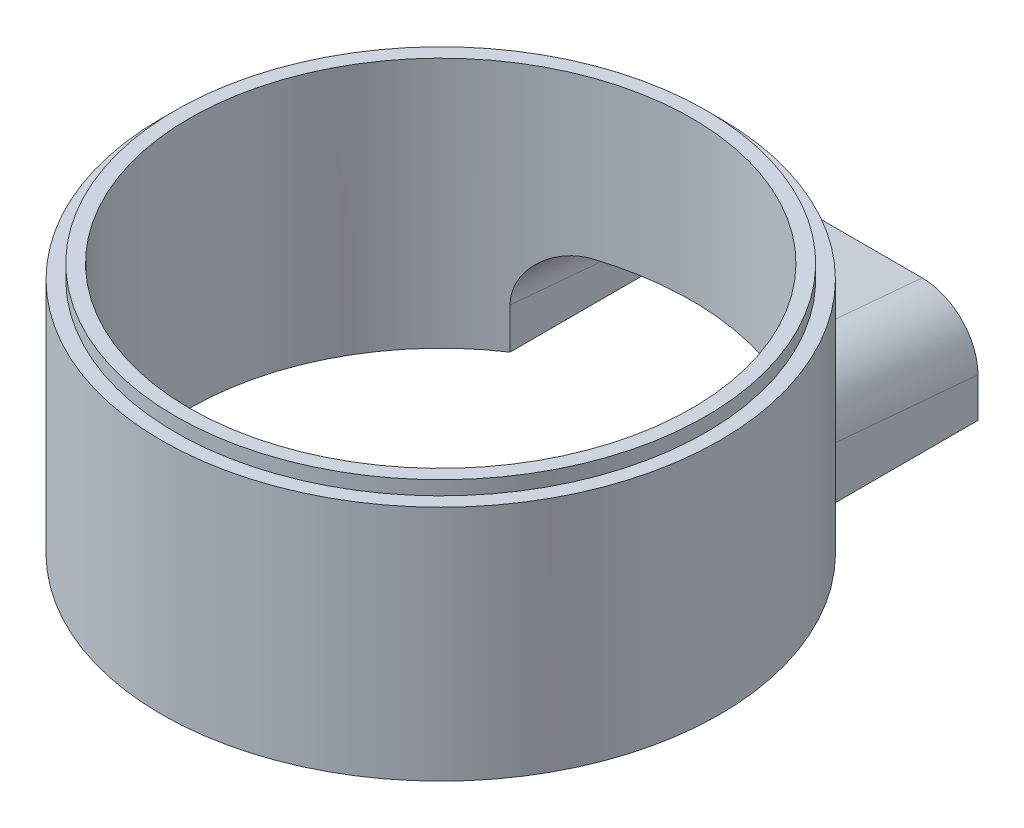
ISO-10303-21;
HEADER;
FILE_DESCRIPTION(('STEP AP214'),'2;1');
FILE_NAME('part.step','',(''),(''),'','','');
FILE_SCHEMA(('AUTOMOTIVE_DESIGN { 1 0 10303 214 1 1 1 1 }'));
ENDSEC;
DATA;
#1=APPLICATION_CONTEXT('core data for automotive mechanical design processes');
#2=APPLICATION_PROTOCOL_DEFINITION('international standard','automotive_design',2000,#1);
#3=PRODUCT_CONTEXT('',#1,'mechanical');
#4=PRODUCT('Part','Part','',(#3));
#5=PRODUCT_RELATED_PRODUCT_CATEGORY('part','',(#4));
#6=PRODUCT_DEFINITION_FORMATION('','',#4);
#7=PRODUCT_DEFINITION_CONTEXT('part definition',#1,'design');
#8=PRODUCT_DEFINITION('design','',#6,#7);
#9=PRODUCT_DEFINITION_SHAPE('','',#8);
#10=(LENGTH_UNIT() NAMED_UNIT(*) SI_UNIT(.MILLI.,.METRE.));
#11=(NAMED_UNIT(*) PLANE_ANGLE_UNIT() SI_UNIT($,.RADIAN.));
#12=(NAMED_UNIT(*) SI_UNIT($,.STERADIAN.) SOLID_ANGLE_UNIT());
#13=UNCERTAINTY_MEASURE_WITH_UNIT(LENGTH_MEASURE(1.E-05),#10,'distance_accuracy_value','');
#14=(GEOMETRIC_REPRESENTATION_CONTEXT(3) GLOBAL_UNCERTAINTY_ASSIGNED_CONTEXT((#13)) GLOBAL_UNIT_ASSIGNED_CONTEXT((#10,
#11,#12)) REPRESENTATION_CONTEXT('',''));
#15=CARTESIAN_POINT('',(0.,0.,0.));
#16=DIRECTION('',(0.,0.,1.));
#17=DIRECTION('',(1.,0.,0.));
#18=AXIS2_PLACEMENT_3D('',#15,#16,#17);
#19=CARTESIAN_POINT('',(-20.,0.,0.));
#20=DIRECTION('',(0.,-1.,0.));
#21=DIRECTION('',(0.,0.,-1.));
#22=AXIS2_PLACEMENT_3D('',#19,#20,#21);
#23=PLANE('',#22);
#24=CARTESIAN_POINT('',(0.,0.,0.));
#25=DIRECTION('',(0.,-1.,0.));
#26=DIRECTION('',(0.,0.,-1.));
#27=AXIS2_PLACEMENT_3D('',#24,#25,#26);
#28=CIRCLE('',#27,20.);
#29=CARTESIAN_POINT('',(0.,0.,-20.));
#30=VERTEX_POINT('',#29);
#31=EDGE_CURVE('E53',#30,#30,#28,.T.);
#32=ORIENTED_EDGE('',*,*,#31,.F.);
#33=EDGE_LOOP('',(#32));
#34=FACE_BOUND('',#33,.T.);
#35=CARTESIAN_POINT('',(0.,0.,0.));
#36=DIRECTION('',(0.,-1.,0.));
#37=DIRECTION('',(0.,0.,-1.));
#38=AXIS2_PLACEMENT_3D('',#35,#36,#37);
#39=CIRCLE('',#38,19.);
#40=CARTESIAN_POINT('',(0.,0.,-19.));
#41=VERTEX_POINT('',#40);
#42=EDGE_CURVE('E13',#41,#41,#39,.F.);
#43=ORIENTED_EDGE('',*,*,#42,.F.);
#44=EDGE_LOOP('',(#43));
#45=FACE_BOUND('',#44,.T.);
#46=ADVANCED_FACE('F45',(#34,#45),#23,.F.);
#47=CARTESIAN_POINT('',(-11.,-17.,-35.2988032844727));
#48=DIRECTION('',(-1.,0.,0.));
#49=DIRECTION('',(0.,0.,1.));
#50=AXIS2_PLACEMENT_3D('',#47,#48,#49);
#51=PLANE('',#50);
#52=DIRECTION('',(0.,-1.,0.));
#53=VECTOR('',#52,1.);
#54=CARTESIAN_POINT('',(-11.,30.06,-21.1));
#55=LINE('',#54,#53);
#56=CARTESIAN_POINT('',(-11.,-13.6115168800519,-21.1));
#57=VERTEX_POINT('',#56);
#58=CARTESIAN_POINT('',(-11.,-17.,-21.1));
#59=VERTEX_POINT('',#58);
#60=EDGE_CURVE('E72',#57,#59,#55,.T.);
#61=ORIENTED_EDGE('',*,*,#60,.F.);
#62=DIRECTION('',(0.,0.0871557427476585,0.996194698091746));
#63=VECTOR('',#62,1.);
#64=CARTESIAN_POINT('',(-11.,-14.1409437688114,-27.1513770290094));
#65=LINE('',#64,#63);
#66=CARTESIAN_POINT('',(-11.,-14.1714443266178,-27.5));
#67=VERTEX_POINT('',#66);
#68=EDGE_CURVE('E329',#57,#67,#65,.F.);
#69=ORIENTED_EDGE('',*,*,#68,.T.);
#70=DIRECTION('',(0.,1.,0.));
#71=VECTOR('',#70,1.);
#72=CARTESIAN_POINT('',(-11.,-17.,-27.5));
#73=LINE('',#72,#71);
#74=CARTESIAN_POINT('',(-11.,-17.,-27.5));
#75=VERTEX_POINT('',#74);
#76=EDGE_CURVE('E279',#75,#67,#73,.T.);
#77=ORIENTED_EDGE('',*,*,#76,.F.);
#78=DIRECTION('',(0.,0.,1.));
#79=VECTOR('',#78,1.);
#80=CARTESIAN_POINT('',(-11.,-17.,-35.2988032844727));
#81=LINE('',#80,#79);
#82=EDGE_CURVE('E280',#75,#59,#81,.T.);
#83=ORIENTED_EDGE('',*,*,#82,.T.);
#84=EDGE_LOOP('',(#61,#69,#77,#83));
#85=FACE_BOUND('',#84,.T.);
#86=ADVANCED_FACE('F194',(#85),#51,.T.);
#87=CARTESIAN_POINT('',(0.,-17.,0.));
#88=DIRECTION('',(0.,1.,0.));
#89=DIRECTION('',(0.,0.,1.));
#90=AXIS2_PLACEMENT_3D('',#87,#88,#89);
#91=CYLINDRICAL_SURFACE('',#90,18.);
#92=DIRECTION('',(0.,1.,0.));
#93=VECTOR('',#92,1.);
#94=CARTESIAN_POINT('',(-10.,-49.,-14.9666295470958));
#95=LINE('',#94,#93);
#96=CARTESIAN_POINT('',(-10.,-17.,-14.9666295470958));
#97=VERTEX_POINT('',#96);
#98=CARTESIAN_POINT('',(-10.,-14.0749164962179,-14.9666295470958));
#99=VERTEX_POINT('',#98);
#100=EDGE_CURVE('E150',#97,#99,#95,.T.);
#101=ORIENTED_EDGE('',*,*,#100,.T.);
#102=CARTESIAN_POINT('',(-10.,-14.0749164962179,-14.9666295470958));
#103=CARTESIAN_POINT('',(-10.0000192439387,-13.9772727528063,-14.9666088474345));
#104=CARTESIAN_POINT('',(-9.99645265102725,-13.8796295507783,-14.9689994671861));
#105=CARTESIAN_POINT('',(-9.9821959398494,-13.6851246863894,-14.978514629552));
#106=CARTESIAN_POINT('',(-9.97150786411735,-13.5882628079946,-14.9856378148031));
#107=CARTESIAN_POINT('',(-9.94312733238616,-13.3965241381069,-15.0044823113195));
#108=CARTESIAN_POINT('',(-9.92547012061388,-13.3016398491449,-15.0161804833418));
#109=CARTESIAN_POINT('',(-9.88332553664603,-13.1140576809074,-15.0439528268849));
#110=CARTESIAN_POINT('',(-9.85883805242617,-13.0213598375192,-15.0600270701783));
#111=CARTESIAN_POINT('',(-9.80330668483393,-12.8388620393709,-15.0962337115963));
#112=CARTESIAN_POINT('',(-9.77226898143158,-12.7490594444349,-15.1163622837514));
#113=CARTESIAN_POINT('',(-9.70393996079367,-12.5727867606324,-15.1603166167006));
#114=CARTESIAN_POINT('',(-9.66664621250896,-12.4863179833875,-15.1841438144813));
#115=CARTESIAN_POINT('',(-9.54585478151993,-12.2325425509232,-15.2605941962955));
#116=CARTESIAN_POINT('',(-9.45344555070383,-12.0708623755188,-15.3181870737186));
#117=CARTESIAN_POINT('',(-9.24267772160401,-11.75752797263,-15.4463218546252));
#118=CARTESIAN_POINT('',(-9.12321429135459,-11.6068410825988,-15.5173836486455));
#119=CARTESIAN_POINT('',(-8.86484275484491,-11.3271224297119,-15.6664231077365));
#120=CARTESIAN_POINT('',(-8.72592669798083,-11.1980995689523,-15.7444035957906));
#121=CARTESIAN_POINT('',(-8.4104515739658,-10.9459769762072,-15.9154307822104));
#122=CARTESIAN_POINT('',(-8.23135370353275,-10.82642733343,-16.0090262669206));
#123=CARTESIAN_POINT('',(-7.85579638728917,-10.6187932375236,-16.1966192304145));
#124=CARTESIAN_POINT('',(-7.65932866397442,-10.5307238880624,-16.2906168803222));
#125=CARTESIAN_POINT('',(-7.34134446041156,-10.4185870191538,-16.4353507357334));
#126=CARTESIAN_POINT('',(-7.22416416985737,-10.3833128980276,-16.4872138322529));
#127=CARTESIAN_POINT('',(-6.98636333781446,-10.3236222452548,-16.5893777084539));
#128=CARTESIAN_POINT('',(-6.86574256003139,-10.2992064612841,-16.6396783803294));
#129=CARTESIAN_POINT('',(-6.62182737541454,-10.2614900874847,-16.7382403264165));
#130=CARTESIAN_POINT('',(-6.49853062463912,-10.2481996819388,-16.7864996937195));
#131=CARTESIAN_POINT('',(-6.25027633825926,-10.232991698192,-16.8805156337666));
#132=CARTESIAN_POINT('',(-6.12531858317151,-10.2310756382626,-16.9262718715802));
#133=CARTESIAN_POINT('',(-6.,-10.2349585836286,-16.9705627484771));
#134=B_SPLINE_CURVE_WITH_KNOTS('',3,(#102,#103,#104,#105,#106,#107,#108,#109,#110,#111,#112,
#113,#114,#115,#116,#117,#118,#119,#120,#121,#122,#123,#124,#125,#126,#127,#128,#129,#130,#131,
#132,#133),.UNSPECIFIED.,.F.,.F.,(4,2,2,2,2,2,2,2,2,2,2,2,2,2,2,4),(0.,0.292834848824691,
0.585585744921451,0.876874733990245,1.16816850081305,1.45918865807513,1.75032216653494,
2.33257521261783,2.94529604664971,3.55826804455234,4.25981687238871,4.96170184014308,
5.36000614149838,5.75833786477165,6.15703382737284,6.55578300755026),.UNSPECIFIED.);
#135=CARTESIAN_POINT('',(-6.,-10.2349585836286,-16.9705627484771));
#136=VERTEX_POINT('',#135);
#137=EDGE_CURVE('E162',#99,#136,#134,.T.);
#138=ORIENTED_EDGE('',*,*,#137,.T.);
#139=CARTESIAN_POINT('',(0.,-8.75022672948152,0.));
#140=DIRECTION('',(0.,-0.996194698091746,0.0871557427476581));
#141=DIRECTION('',(0.,0.0871557427476581,0.996194698091746));
#142=AXIS2_PLACEMENT_3D('',#139,#140,#141);
#143=ELLIPSE('',#142,18.0687570757803,18.);
#144=CARTESIAN_POINT('',(5.99999999999999,-10.2349585836286,-16.9705627484771));
#145=VERTEX_POINT('',#144);
#146=EDGE_CURVE('E322',#136,#145,#143,.T.);
#147=ORIENTED_EDGE('',*,*,#146,.T.);
#148=CARTESIAN_POINT('',(6.,-10.2349585836286,-16.9705627484771));
#149=CARTESIAN_POINT('',(6.12103692366107,-10.2312089489196,-16.9277835149125));
#150=CARTESIAN_POINT('',(6.2417383785382,-10.2328680109724,-16.8836390213075));
#151=CARTESIAN_POINT('',(6.48160917755365,-10.246804387905,-16.793006105914));
#152=CARTESIAN_POINT('',(6.60077887122443,-10.2590792350925,-16.7465182312211));
#153=CARTESIAN_POINT('',(6.83670692164913,-10.2940353582697,-16.6515951218195));
#154=CARTESIAN_POINT('',(6.95346676447146,-10.3167100077533,-16.6031611450237));
#155=CARTESIAN_POINT('',(7.18386430369053,-10.3722205817421,-16.5047815617096));
#156=CARTESIAN_POINT('',(7.29750183665548,-10.4050570370501,-16.4548358763501));
#157=CARTESIAN_POINT('',(7.63252474427568,-10.5184276227269,-16.303507187986));
#158=CARTESIAN_POINT('',(7.84833158170355,-10.613869658855,-16.2005064432086));
#159=CARTESIAN_POINT('',(8.25928013692895,-10.8427043853422,-15.9949100749561));
#160=CARTESIAN_POINT('',(8.45441146434192,-10.9761160341892,-15.8923146798861));
#161=CARTESIAN_POINT('',(8.72735828771197,-11.2031396207395,-15.7430653481422));
#162=CARTESIAN_POINT('',(8.81516384007176,-11.2834370364619,-15.6940205681078));
#163=CARTESIAN_POINT('',(8.98337356199844,-11.4527190111467,-15.5983437781418));
#164=CARTESIAN_POINT('',(9.06378141984061,-11.541699195032,-15.5517105710045));
#165=CARTESIAN_POINT('',(9.21638092873654,-11.7279499172437,-15.4617649598591));
#166=CARTESIAN_POINT('',(9.28857508967325,-11.8252179070663,-15.4184515427407));
#167=CARTESIAN_POINT('',(9.42391649326395,-12.027550846041,-15.3361035468667));
#168=CARTESIAN_POINT('',(9.48706544367155,-12.1326143176895,-15.2970681607383));
#169=CARTESIAN_POINT('',(9.59755078940774,-12.3388355111745,-15.2279620671847));
#170=CARTESIAN_POINT('',(9.64584067498894,-12.4393125173287,-15.1973839142909));
#171=CARTESIAN_POINT('',(9.73378179046371,-12.6453047882546,-15.1412092156678));
#172=CARTESIAN_POINT('',(9.77343493809764,-12.7508189282015,-15.1156115641802));
#173=CARTESIAN_POINT('',(9.84348095315603,-12.9658230525761,-15.0700905297486));
#174=CARTESIAN_POINT('',(9.87389243198561,-13.0753045426275,-15.0501557479458));
#175=CARTESIAN_POINT('',(9.92510646084028,-13.2973601729843,-15.0164310696323));
#176=CARTESIAN_POINT('',(9.94591502861411,-13.4099323295021,-15.0026373249785));
#177=CARTESIAN_POINT('',(9.97452917381337,-13.6145906368541,-14.9836247408117));
#178=CARTESIAN_POINT('',(9.98409164854502,-13.7063293933814,-14.9772500920201));
#179=CARTESIAN_POINT('',(9.99683050657367,-13.8903481163145,-14.9687471351695));
#180=CARTESIAN_POINT('',(10.0000135586626,-13.9826274163107,-14.9666143928098));
#181=CARTESIAN_POINT('',(10.,-14.0749164962179,-14.9666295470958));
#182=B_SPLINE_CURVE_WITH_KNOTS('',3,(#148,#149,#150,#151,#152,#153,#154,#155,#156,#157,#158,
#159,#160,#161,#162,#163,#164,#165,#166,#167,#168,#169,#170,#171,#172,#173,#174,#175,#176,#177,
#178,#179,#180,#181),.UNSPECIFIED.,.F.,.F.,(4,2,2,2,2,2,2,2,2,2,2,2,2,2,2,2,4),(0.,
0.385137199014157,0.770184895016971,1.15498758791677,1.53981038440893,2.30845171251629,
3.07747750385634,3.46313087769567,3.84859092203357,4.23393286207672,4.61920195263162,
4.96548233673395,5.31168575260932,5.65718727182229,6.00247198447705,6.27952896119679,
6.55629616231065),.UNSPECIFIED.);
#183=CARTESIAN_POINT('',(10.,-14.0749164962179,-14.9666295470958));
#184=VERTEX_POINT('',#183);
#185=EDGE_CURVE('E178',#145,#184,#182,.T.);
#186=ORIENTED_EDGE('',*,*,#185,.T.);
#187=DIRECTION('',(0.,1.,0.));
#188=VECTOR('',#187,1.);
#189=CARTESIAN_POINT('',(10.,-49.,-14.9666295470958));
#190=LINE('',#189,#188);
#191=CARTESIAN_POINT('',(10.,-17.,-14.9666295470958));
#192=VERTEX_POINT('',#191);
#193=EDGE_CURVE('E166',#184,#192,#190,.F.);
#194=ORIENTED_EDGE('',*,*,#193,.T.);
#195=CARTESIAN_POINT('',(0.,-17.,0.));
#196=DIRECTION('',(0.,-1.,0.));
#197=DIRECTION('',(0.,0.,-1.));
#198=AXIS2_PLACEMENT_3D('',#195,#196,#197);
#199=CIRCLE('',#198,18.);
#200=EDGE_CURVE('E165',#192,#97,#199,.T.);
#201=ORIENTED_EDGE('',*,*,#200,.T.);
#202=EDGE_LOOP('',(#101,#138,#147,#186,#194,#201));
#203=FACE_BOUND('',#202,.T.);
#204=CARTESIAN_POINT('',(0.,1.,0.));
#205=DIRECTION('',(0.,1.,0.));
#206=DIRECTION('',(0.,0.,1.));
#207=AXIS2_PLACEMENT_3D('',#204,#205,#206);
#208=CIRCLE('',#207,18.);
#209=CARTESIAN_POINT('',(0.,1.,18.));
#210=VERTEX_POINT('',#209);
#211=EDGE_CURVE('E480',#210,#210,#208,.T.);
#212=ORIENTED_EDGE('',*,*,#211,.T.);
#213=EDGE_LOOP('',(#212));
#214=FACE_BOUND('',#213,.T.);
#215=ADVANCED_FACE('F159',(#203,#214),#91,.F.);
#216=CARTESIAN_POINT('',(10.,-10.5,-20.0735016887819));
#217=DIRECTION('',(1.,0.,0.));
#218=DIRECTION('',(0.,1.,0.));
#219=AXIS2_PLACEMENT_3D('',#216,#217,#218);
#220=PLANE('',#219);
#221=ORIENTED_EDGE('',*,*,#193,.F.);
#222=DIRECTION('',(0.,-0.0871557427476582,-0.996194698091746));
#223=VECTOR('',#222,1.);
#224=CARTESIAN_POINT('',(10.,-15.1409437688114,-27.1513770290094));
#225=LINE('',#224,#223);
#226=CARTESIAN_POINT('',(10.,-15.1714443266178,-27.5));
#227=VERTEX_POINT('',#226);
#228=EDGE_CURVE('E336',#184,#227,#225,.T.);
#229=ORIENTED_EDGE('',*,*,#228,.T.);
#230=DIRECTION('',(0.,1.,0.));
#231=VECTOR('',#230,1.);
#232=CARTESIAN_POINT('',(10.,-9.2655748326135,-27.5));
#233=LINE('',#232,#231);
#234=CARTESIAN_POINT('',(10.,-17.,-27.5));
#235=VERTEX_POINT('',#234);
#236=EDGE_CURVE('E296',#235,#227,#233,.T.);
#237=ORIENTED_EDGE('',*,*,#236,.F.);
#238=DIRECTION('',(0.,0.,1.));
#239=VECTOR('',#238,1.);
#240=CARTESIAN_POINT('',(10.,-17.,-20.0735016887819));
#241=LINE('',#240,#239);
#242=EDGE_CURVE('E314',#235,#192,#241,.T.);
#243=ORIENTED_EDGE('',*,*,#242,.T.);
#244=EDGE_LOOP('',(#221,#229,#237,#243));
#245=FACE_BOUND('',#244,.T.);
#246=ADVANCED_FACE('F193',(#245),#220,.F.);
#247=CARTESIAN_POINT('',(-10.,-10.5,-20.0735016887819));
#248=DIRECTION('',(-1.,0.,0.));
#249=DIRECTION('',(0.,0.,1.));
#250=AXIS2_PLACEMENT_3D('',#247,#248,#249);
#251=PLANE('',#250);
#252=DIRECTION('',(0.,-1.,0.));
#253=VECTOR('',#252,1.);
#254=CARTESIAN_POINT('',(-10.,-9.2655748326135,-27.5));
#255=LINE('',#254,#253);
#256=CARTESIAN_POINT('',(-10.,-15.1714443266178,-27.5));
#257=VERTEX_POINT('',#256);
#258=CARTESIAN_POINT('',(-10.,-17.,-27.5));
#259=VERTEX_POINT('',#258);
#260=EDGE_CURVE('E151',#257,#259,#255,.T.);
#261=ORIENTED_EDGE('',*,*,#260,.F.);
#262=DIRECTION('',(0.,-0.0871557427476582,-0.996194698091746));
#263=VECTOR('',#262,1.);
#264=CARTESIAN_POINT('',(-10.,-14.0444159384115,-14.6180065761051));
#265=LINE('',#264,#263);
#266=EDGE_CURVE('E146',#257,#99,#265,.F.);
#267=ORIENTED_EDGE('',*,*,#266,.T.);
#268=ORIENTED_EDGE('',*,*,#100,.F.);
#269=DIRECTION('',(0.,0.,1.));
#270=VECTOR('',#269,1.);
#271=CARTESIAN_POINT('',(-10.,-17.,-20.0735016887819));
#272=LINE('',#271,#270);
#273=EDGE_CURVE('E313',#259,#97,#272,.T.);
#274=ORIENTED_EDGE('',*,*,#273,.F.);
#275=EDGE_LOOP('',(#261,#267,#268,#274));
#276=FACE_BOUND('',#275,.T.);
#277=ADVANCED_FACE('F148',(#276),#251,.F.);
#278=CARTESIAN_POINT('',(0.,2.,0.));
#279=DIRECTION('',(0.,-1.,0.));
#280=DIRECTION('',(0.,0.,-1.));
#281=AXIS2_PLACEMENT_3D('',#278,#279,#280);
#282=CYLINDRICAL_SURFACE('',#281,20.);
#283=ORIENTED_EDGE('',*,*,#31,.T.);
#284=EDGE_LOOP('',(#283));
#285=FACE_BOUND('',#284,.T.);
#286=CARTESIAN_POINT('',(0.,-7.75022672948151,0.));
#287=DIRECTION('',(0.,-0.996194698091745,0.0871557427476585));
#288=DIRECTION('',(0.,-0.0871557427476585,-0.996194698091746));
#289=AXIS2_PLACEMENT_3D('',#286,#287,#288);
#290=ELLIPSE('',#289,20.076396750867,20.);
#291=CARTESIAN_POINT('',(-7.,-9.38932631528736,-18.7349939951952));
#292=VERTEX_POINT('',#291);
#293=CARTESIAN_POINT('',(7.,-9.38932631528736,-18.7349939951952));
#294=VERTEX_POINT('',#293);
#295=EDGE_CURVE('E310',#292,#294,#290,.T.);
#296=ORIENTED_EDGE('',*,*,#295,.F.);
#297=CARTESIAN_POINT('',(-7.,-9.38932631528736,-18.7349939951952));
#298=CARTESIAN_POINT('',(-7.12152580226291,-9.38534875054601,-18.6896007879187));
#299=CARTESIAN_POINT('',(-7.24274203510451,-9.38683254664327,-18.642950615909));
#300=CARTESIAN_POINT('',(-7.4837002910909,-9.40054333647603,-18.5475306455612));
#301=CARTESIAN_POINT('',(-7.60344258048118,-9.41276836021543,-18.4987612374608));
#302=CARTESIAN_POINT('',(-7.84063201655265,-9.4477791240168,-18.3994847891049));
#303=CARTESIAN_POINT('',(-7.95807937585286,-9.47056388086725,-18.3489779110296));
#304=CARTESIAN_POINT('',(-8.1898891926079,-9.52647175198128,-18.2466927497819));
#305=CARTESIAN_POINT('',(-8.30425152436357,-9.55959528680825,-18.1949144149678));
#306=CARTESIAN_POINT('',(-8.64153633772909,-9.67414359835506,-18.038431401611));
#307=CARTESIAN_POINT('',(-8.85891408800642,-9.77078445684406,-17.9324702560406));
#308=CARTESIAN_POINT('',(-9.27282036554605,-10.0029630600315,-17.7219853664535));
#309=CARTESIAN_POINT('',(-9.46934235334424,-10.1385129558504,-17.617462082177));
#310=CARTESIAN_POINT('',(-9.74312202882056,-10.3687391587965,-17.4666091733719));
#311=CARTESIAN_POINT('',(-9.83063035459747,-10.4496582705106,-17.4174639294578));
#312=CARTESIAN_POINT('',(-9.99821221095189,-10.6202453977172,-17.3218078324059));
#313=CARTESIAN_POINT('',(-10.0782895667158,-10.7099088626402,-17.2752956287401));
#314=CARTESIAN_POINT('',(-10.2301615290275,-10.897566002567,-17.185795678475));
#315=CARTESIAN_POINT('',(-10.3019590975651,-10.9955566766908,-17.142806673098));
#316=CARTESIAN_POINT('',(-10.436419914343,-11.1993490321606,-17.0612813276066));
#317=CARTESIAN_POINT('',(-10.499084978425,-11.3051491544122,-17.0227441026488));
#318=CARTESIAN_POINT('',(-10.6081192197009,-11.5119214840276,-16.9549836655023));
#319=CARTESIAN_POINT('',(-10.655519394146,-11.6121679398155,-16.9252033411622));
#320=CARTESIAN_POINT('',(-10.7417459185163,-11.8175724014156,-16.8706105586133));
#321=CARTESIAN_POINT('',(-10.7805741199002,-11.9227293406571,-16.8457970277361));
#322=CARTESIAN_POINT('',(-10.8490570195489,-12.1368957148756,-16.8017743075123));
#323=CARTESIAN_POINT('',(-10.8787295195772,-12.2458972087645,-16.7825542467686));
#324=CARTESIAN_POINT('',(-10.9285686987535,-12.4668725462385,-16.7501424004156));
#325=CARTESIAN_POINT('',(-10.9487412578653,-12.5788445058014,-16.7369468860836));
#326=CARTESIAN_POINT('',(-10.9760330163437,-12.7802170226424,-16.7190583298865));
#327=CARTESIAN_POINT('',(-10.9850318973797,-12.869260927094,-16.7131435469991));
#328=CARTESIAN_POINT('',(-10.9970175669251,-13.0478187832506,-16.7052570946871));
#329=CARTESIAN_POINT('',(-11.0000115398465,-13.1373320446313,-16.7032807132856));
#330=CARTESIAN_POINT('',(-11.,-13.2268548684487,-16.7032930884901));
#331=B_SPLINE_CURVE_WITH_KNOTS('',3,(#297,#298,#299,#300,#301,#302,#303,#304,#305,#306,#307,
#308,#309,#310,#311,#312,#313,#314,#315,#316,#317,#318,#319,#320,#321,#322,#323,#324,#325,#326,
#327,#328,#329,#330),.UNSPECIFIED.,.F.,.F.,(4,2,2,2,2,2,2,2,2,2,2,2,2,2,2,2,4),(0.,
0.389215741351965,0.778360113442894,1.16746825977099,1.55659223640124,2.33400479080569,
3.1116603923487,3.49798208574542,3.88410379900484,4.27008695074214,4.65599325134222,
4.99994209987995,5.34381658613431,5.68701818914959,6.03000708832237,6.29880534393452,
6.56728181075638),.UNSPECIFIED.);
#332=CARTESIAN_POINT('',(-11.,-13.2268548684487,-16.7032930884901));
#333=VERTEX_POINT('',#332);
#334=EDGE_CURVE('E154',#292,#333,#331,.T.);
#335=ORIENTED_EDGE('',*,*,#334,.T.);
#336=DIRECTION('',(0.,-1.,0.));
#337=VECTOR('',#336,1.);
#338=CARTESIAN_POINT('',(-11.,2.,-16.7032930884901));
#339=LINE('',#338,#337);
#340=CARTESIAN_POINT('',(-11.,-17.,-16.7032930884901));
#341=VERTEX_POINT('',#340);
#342=EDGE_CURVE('E287',#333,#341,#339,.T.);
#343=ORIENTED_EDGE('',*,*,#342,.T.);
#344=CARTESIAN_POINT('',(0.,-17.,0.));
#345=DIRECTION('',(0.,-1.,0.));
#346=DIRECTION('',(0.,0.,-1.));
#347=AXIS2_PLACEMENT_3D('',#344,#345,#346);
#348=CIRCLE('',#347,20.);
#349=CARTESIAN_POINT('',(11.,-17.,-16.7032930884901));
#350=VERTEX_POINT('',#349);
#351=EDGE_CURVE('E319',#350,#341,#348,.T.);
#352=ORIENTED_EDGE('',*,*,#351,.F.);
#353=DIRECTION('',(0.,-1.,0.));
#354=VECTOR('',#353,1.);
#355=CARTESIAN_POINT('',(11.,2.,-16.7032930884901));
#356=LINE('',#355,#354);
#357=CARTESIAN_POINT('',(11.,-13.2268548684487,-16.7032930884901));
#358=VERTEX_POINT('',#357);
#359=EDGE_CURVE('E301',#350,#358,#356,.F.);
#360=ORIENTED_EDGE('',*,*,#359,.T.);
#361=CARTESIAN_POINT('',(11.,-13.2268548684487,-16.7032930884901));
#362=CARTESIAN_POINT('',(11.0000189965907,-13.129083970803,-16.7032735709967));
#363=CARTESIAN_POINT('',(10.9964433827506,-13.031313266519,-16.705635081433));
#364=CARTESIAN_POINT('',(10.9821500845446,-12.8365476957198,-16.715038599504));
#365=CARTESIAN_POINT('',(10.9714342879716,-12.7395526309911,-16.7220793699879));
#366=CARTESIAN_POINT('',(10.942976099292,-12.5475226183758,-16.7407151570516));
#367=CARTESIAN_POINT('',(10.9252676313659,-12.4524805039692,-16.7522881836844));
#368=CARTESIAN_POINT('',(10.8829967027881,-12.2645781817774,-16.7797801502297));
#369=CARTESIAN_POINT('',(10.8584341619481,-12.1717179995331,-16.7956991409873));
#370=CARTESIAN_POINT('',(10.8027245597189,-11.988884739733,-16.8315844668374));
#371=CARTESIAN_POINT('',(10.7715829974154,-11.8989093228345,-16.8515474212067));
#372=CARTESIAN_POINT('',(10.7030203065232,-11.7222978427401,-16.8951770560024));
#373=CARTESIAN_POINT('',(10.6655967453822,-11.6356630891776,-16.9188451709226));
#374=CARTESIAN_POINT('',(10.5443845198789,-11.3814237695451,-16.9948536284119));
#375=CARTESIAN_POINT('',(10.4516490508424,-11.2194670892247,-17.0522015322681));
#376=CARTESIAN_POINT('',(10.2404635960583,-10.9061468542596,-17.1798960554433));
#377=CARTESIAN_POINT('',(10.1209685749459,-10.7557035147458,-17.2507453251691));
#378=CARTESIAN_POINT('',(9.86268172179027,-10.4765630636612,-17.3997051901964));
#379=CARTESIAN_POINT('',(9.72388237116521,-10.3478744685264,-17.4778186107666));
#380=CARTESIAN_POINT('',(9.40934967663285,-10.0969164180687,-17.6493785457043));
#381=CARTESIAN_POINT('',(9.23116917971726,-9.97813065795599,-17.7434308837248));
#382=CARTESIAN_POINT('',(8.85790742641974,-9.77186649057112,-17.932685881928));
#383=CARTESIAN_POINT('',(8.66281624166614,-9.68440663168843,-18.027889189241));
#384=CARTESIAN_POINT('',(8.34587607527613,-9.57246332474135,-18.175883644155));
#385=CARTESIAN_POINT('',(8.22815792674553,-9.53701484916332,-18.2294953661726));
#386=CARTESIAN_POINT('',(7.98933766636212,-9.47712332201084,-18.3354172781035));
#387=CARTESIAN_POINT('',(7.86823523546637,-9.45268131177987,-18.3877273444223));
#388=CARTESIAN_POINT('',(7.6234617867733,-9.41504206447172,-18.4905497755855));
#389=CARTESIAN_POINT('',(7.49978929012824,-9.40185149605687,-18.5410610573315));
#390=CARTESIAN_POINT('',(7.25085508587431,-9.38693759279188,-18.6398277232231));
#391=CARTESIAN_POINT('',(7.12559327380378,-9.3852150156567,-18.6880829580976));
#392=CARTESIAN_POINT('',(7.,-9.38932631528736,-18.7349939951952));
#393=B_SPLINE_CURVE_WITH_KNOTS('',3,(#361,#362,#363,#364,#365,#366,#367,#368,#369,#370,#371,
#372,#373,#374,#375,#376,#377,#378,#379,#380,#381,#382,#383,#384,#385,#386,#387,#388,#389,#390,
#391,#392),.UNSPECIFIED.,.F.,.F.,(4,2,2,2,2,2,2,2,2,2,2,2,2,2,2,4),(0.,0.293217393965305,
0.586357294926824,0.878092195431126,1.16983050919005,1.46132593101948,1.75293448889939,
2.33609771135133,2.94810606829747,3.56035345909444,4.25921601327373,4.95849168976618,
5.3604210161821,5.76238836194191,6.16459378613133,6.56682578463762),.UNSPECIFIED.);
#394=EDGE_CURVE('E218',#358,#294,#393,.T.);
#395=ORIENTED_EDGE('',*,*,#394,.T.);
#396=EDGE_LOOP('',(#296,#335,#343,#352,#360,#395));
#397=FACE_BOUND('',#396,.T.);
#398=ADVANCED_FACE('F228',(#285,#397),#282,.T.);
#399=CARTESIAN_POINT('',(0.,-17.,0.));
#400=DIRECTION('',(0.,-1.,0.));
#401=DIRECTION('',(0.,0.,-1.));
#402=AXIS2_PLACEMENT_3D('',#399,#400,#401);
#403=PLANE('',#402);
#404=CARTESIAN_POINT('',(-11.,-17.,-20.5));
#405=DIRECTION('',(0.,-1.,0.));
#406=DIRECTION('',(0.,0.,-1.));
#407=AXIS2_PLACEMENT_3D('',#404,#405,#406);
#408=CIRCLE('',#407,0.6);
#409=CARTESIAN_POINT('',(-11.,-17.,-19.9));
#410=VERTEX_POINT('',#409);
#411=EDGE_CURVE('E167',#59,#410,#408,.T.);
#412=ORIENTED_EDGE('',*,*,#411,.F.);
#413=ORIENTED_EDGE('',*,*,#82,.F.);
#414=DIRECTION('',(-1.,0.,0.));
#415=VECTOR('',#414,1.);
#416=CARTESIAN_POINT('',(-10.,-17.,-27.5));
#417=LINE('',#416,#415);
#418=EDGE_CURVE('E283',#259,#75,#417,.T.);
#419=ORIENTED_EDGE('',*,*,#418,.F.);
#420=ORIENTED_EDGE('',*,*,#273,.T.);
#421=ORIENTED_EDGE('',*,*,#200,.F.);
#422=ORIENTED_EDGE('',*,*,#242,.F.);
#423=DIRECTION('',(-1.,0.,0.));
#424=VECTOR('',#423,1.);
#425=CARTESIAN_POINT('',(10.,-17.,-27.5));
#426=LINE('',#425,#424);
#427=CARTESIAN_POINT('',(11.,-17.,-27.5));
#428=VERTEX_POINT('',#427);
#429=EDGE_CURVE('E291',#428,#235,#426,.T.);
#430=ORIENTED_EDGE('',*,*,#429,.F.);
#431=DIRECTION('',(0.,0.,1.));
#432=VECTOR('',#431,1.);
#433=CARTESIAN_POINT('',(11.,-17.,-35.2988032844727));
#434=LINE('',#433,#432);
#435=EDGE_CURVE('E290',#428,#350,#434,.T.);
#436=ORIENTED_EDGE('',*,*,#435,.T.);
#437=ORIENTED_EDGE('',*,*,#351,.T.);
#438=EDGE_CURVE('E277',#410,#341,#81,.T.);
#439=ORIENTED_EDGE('',*,*,#438,.F.);
#440=EDGE_LOOP('',(#412,#413,#419,#420,#421,#422,#430,#436,#437,#439));
#441=FACE_BOUND('',#440,.T.);
#442=ADVANCED_FACE('F196',(#441),#403,.T.);
#443=CARTESIAN_POINT('',(20.6738533242506,-11.1561649764444,-27.5));
#444=DIRECTION('',(0.,0.996194698091746,-0.0871557427476582));
#445=DIRECTION('',(0.,0.0871557427476582,0.996194698091746));
#446=AXIS2_PLACEMENT_3D('',#443,#444,#445);
#447=PLANE('',#446);
#448=DIRECTION('',(-1.,0.,0.));
#449=VECTOR('',#448,1.);
#450=CARTESIAN_POINT('',(20.6738533242506,-11.1561649764444,-27.5));
#451=LINE('',#450,#449);
#452=CARTESIAN_POINT('',(6.,-11.1561649764444,-27.5));
#453=VERTEX_POINT('',#452);
#454=CARTESIAN_POINT('',(-6.,-11.1561649764444,-27.5));
#455=VERTEX_POINT('',#454);
#456=EDGE_CURVE('E304',#453,#455,#451,.T.);
#457=ORIENTED_EDGE('',*,*,#456,.F.);
#458=DIRECTION('',(0.,-0.0871557427476582,-0.996194698091746));
#459=VECTOR('',#458,1.);
#460=CARTESIAN_POINT('',(6.,-10.0596371460445,-14.9666295470958));
#461=LINE('',#460,#459);
#462=EDGE_CURVE('E155',#453,#145,#461,.F.);
#463=ORIENTED_EDGE('',*,*,#462,.T.);
#464=ORIENTED_EDGE('',*,*,#146,.F.);
#465=DIRECTION('',(0.,-0.0871557427476582,-0.996194698091746));
#466=VECTOR('',#465,1.);
#467=CARTESIAN_POINT('',(-6.,-11.1561649764444,-27.5));
#468=LINE('',#467,#466);
#469=EDGE_CURVE('E172',#136,#455,#468,.T.);
#470=ORIENTED_EDGE('',*,*,#469,.T.);
#471=EDGE_LOOP('',(#457,#463,#464,#470));
#472=FACE_BOUND('',#471,.T.);
#473=ADVANCED_FACE('F237',(#472),#447,.F.);
#474=CARTESIAN_POINT('',(20.6738533242506,-10.1561649764444,-27.5));
#475=DIRECTION('',(0.,0.,1.));
#476=DIRECTION('',(1.,0.,0.));
#477=AXIS2_PLACEMENT_3D('',#474,#475,#476);
#478=PLANE('',#477);
#479=ORIENTED_EDGE('',*,*,#76,.T.);
#480=CARTESIAN_POINT('',(-7.,-14.1714443266178,-27.5));
#481=DIRECTION('',(0.,0.,1.));
#482=DIRECTION('',(0.,-1.,0.));
#483=AXIS2_PLACEMENT_3D('',#480,#481,#482);
#484=ELLIPSE('',#483,4.01527935017339,4.);
#485=CARTESIAN_POINT('',(-7.,-10.1561649764444,-27.5));
#486=VERTEX_POINT('',#485);
#487=EDGE_CURVE('E176',#67,#486,#484,.F.);
#488=ORIENTED_EDGE('',*,*,#487,.T.);
#489=DIRECTION('',(-1.,0.,0.));
#490=VECTOR('',#489,1.);
#491=CARTESIAN_POINT('',(20.6738533242506,-10.1561649764444,-27.5));
#492=LINE('',#491,#490);
#493=CARTESIAN_POINT('',(7.,-10.1561649764444,-27.5));
#494=VERTEX_POINT('',#493);
#495=EDGE_CURVE('E307',#494,#486,#492,.T.);
#496=ORIENTED_EDGE('',*,*,#495,.F.);
#497=CARTESIAN_POINT('',(7.,-14.1714443266178,-27.5));
#498=DIRECTION('',(0.,0.,1.));
#499=DIRECTION('',(0.,-1.,0.));
#500=AXIS2_PLACEMENT_3D('',#497,#498,#499);
#501=ELLIPSE('',#500,4.01527935017339,4.);
#502=CARTESIAN_POINT('',(11.,-14.1714443266178,-27.5));
#503=VERTEX_POINT('',#502);
#504=EDGE_CURVE('E173',#494,#503,#501,.F.);
#505=ORIENTED_EDGE('',*,*,#504,.T.);
#506=DIRECTION('',(0.,-1.,0.));
#507=VECTOR('',#506,1.);
#508=CARTESIAN_POINT('',(11.,-17.,-27.5));
#509=LINE('',#508,#507);
#510=EDGE_CURVE('E294',#503,#428,#509,.T.);
#511=ORIENTED_EDGE('',*,*,#510,.T.);
#512=ORIENTED_EDGE('',*,*,#429,.T.);
#513=ORIENTED_EDGE('',*,*,#236,.T.);
#514=CARTESIAN_POINT('',(6.,-15.1714443266178,-27.5));
#515=DIRECTION('',(0.,0.,1.));
#516=DIRECTION('',(0.,1.,0.));
#517=AXIS2_PLACEMENT_3D('',#514,#515,#516);
#518=ELLIPSE('',#517,4.01527935017339,4.);
#519=EDGE_CURVE('E204',#227,#453,#518,.T.);
#520=ORIENTED_EDGE('',*,*,#519,.T.);
#521=ORIENTED_EDGE('',*,*,#456,.T.);
#522=CARTESIAN_POINT('',(-6.,-15.1714443266178,-27.5));
#523=DIRECTION('',(0.,0.,1.));
#524=DIRECTION('',(0.,1.,0.));
#525=AXIS2_PLACEMENT_3D('',#522,#523,#524);
#526=ELLIPSE('',#525,4.01527935017339,4.);
#527=EDGE_CURVE('E174',#455,#257,#526,.T.);
#528=ORIENTED_EDGE('',*,*,#527,.T.);
#529=ORIENTED_EDGE('',*,*,#260,.T.);
#530=ORIENTED_EDGE('',*,*,#418,.T.);
#531=EDGE_LOOP('',(#479,#488,#496,#505,#511,#512,#513,#520,#521,#528,#529,#530));
#532=FACE_BOUND('',#531,.T.);
#533=ADVANCED_FACE('F349',(#532),#478,.F.);
#534=CARTESIAN_POINT('',(20.6738533242506,-9.23753400942222,-17.));
#535=DIRECTION('',(0.,-0.996194698091745,0.0871557427476585));
#536=DIRECTION('',(0.,-0.0871557427476585,-0.996194698091746));
#537=AXIS2_PLACEMENT_3D('',#534,#535,#536);
#538=PLANE('',#537);
#539=ORIENTED_EDGE('',*,*,#495,.T.);
#540=DIRECTION('',(0.,0.0871557427476585,0.996194698091746));
#541=VECTOR('',#540,1.);
#542=CARTESIAN_POINT('',(-7.,-9.21157551827532,-16.7032930884901));
#543=LINE('',#542,#541);
#544=EDGE_CURVE('E326',#486,#292,#543,.T.);
#545=ORIENTED_EDGE('',*,*,#544,.T.);
#546=ORIENTED_EDGE('',*,*,#295,.T.);
#547=DIRECTION('',(0.,0.0871557427476585,0.996194698091746));
#548=VECTOR('',#547,1.);
#549=CARTESIAN_POINT('',(7.,-10.1561649764444,-27.5));
#550=LINE('',#549,#548);
#551=EDGE_CURVE('E324',#294,#494,#550,.F.);
#552=ORIENTED_EDGE('',*,*,#551,.T.);
#553=EDGE_LOOP('',(#539,#545,#546,#552));
#554=FACE_BOUND('',#553,.T.);
#555=ADVANCED_FACE('F372',(#554),#538,.F.);
#556=CARTESIAN_POINT('',(11.,-17.,-35.2988032844727));
#557=DIRECTION('',(1.,0.,0.));
#558=DIRECTION('',(0.,0.,-1.));
#559=AXIS2_PLACEMENT_3D('',#556,#557,#558);
#560=PLANE('',#559);
#561=ORIENTED_EDGE('',*,*,#510,.F.);
#562=DIRECTION('',(0.,0.0871557427476585,0.996194698091746));
#563=VECTOR('',#562,1.);
#564=CARTESIAN_POINT('',(11.,-13.1963543106423,-16.3546701174994));
#565=LINE('',#564,#563);
#566=EDGE_CURVE('E333',#503,#358,#565,.T.);
#567=ORIENTED_EDGE('',*,*,#566,.T.);
#568=ORIENTED_EDGE('',*,*,#359,.F.);
#569=ORIENTED_EDGE('',*,*,#435,.F.);
#570=EDGE_LOOP('',(#561,#567,#568,#569));
#571=FACE_BOUND('',#570,.T.);
#572=ADVANCED_FACE('F355',(#571),#560,.T.);
#573=DIRECTION('',(0.,-1.,0.));
#574=VECTOR('',#573,1.);
#575=CARTESIAN_POINT('',(-11.,30.06,-19.9));
#576=LINE('',#575,#574);
#577=CARTESIAN_POINT('',(-11.,-13.5065304838208,-19.9));
#578=VERTEX_POINT('',#577);
#579=EDGE_CURVE('E61',#578,#410,#576,.T.);
#580=ORIENTED_EDGE('',*,*,#579,.T.);
#581=ORIENTED_EDGE('',*,*,#438,.T.);
#582=ORIENTED_EDGE('',*,*,#342,.F.);
#583=EDGE_CURVE('E330',#333,#578,#65,.F.);
#584=ORIENTED_EDGE('',*,*,#583,.T.);
#585=EDGE_LOOP('',(#580,#581,#582,#584));
#586=FACE_BOUND('',#585,.T.);
#587=ADVANCED_FACE('F249',(#586),#51,.T.);
#588=CARTESIAN_POINT('',(-7.,-13.2223128017892,-16.6513770290094));
#589=DIRECTION('',(0.,-0.0871557427476585,-0.996194698091746));
#590=DIRECTION('',(0.,0.996194698091746,-0.0871557427476585));
#591=AXIS2_PLACEMENT_3D('',#588,#589,#590);
#592=CYLINDRICAL_SURFACE('',#591,4.);
#593=CARTESIAN_POINT('',(-11.,-13.5065304838208,-19.9));
#594=CARTESIAN_POINT('',(-11.0000002089521,-13.4568478030407,-19.9000087820531));
#595=CARTESIAN_POINT('',(-10.9990813492809,-13.4071657584378,-19.9000001769292));
#596=CARTESIAN_POINT('',(-10.9954076250842,-13.307868243668,-19.900012477824));
#597=CARTESIAN_POINT('',(-10.9926527101823,-13.2582527753653,-19.9000333846524));
#598=CARTESIAN_POINT('',(-10.9852993347966,-13.1590259163366,-19.900169180161));
#599=CARTESIAN_POINT('',(-10.9806960366848,-13.1094148807031,-19.9002843162875));
#600=CARTESIAN_POINT('',(-10.9696511830939,-13.0104045345917,-19.900743373173));
#601=CARTESIAN_POINT('',(-10.963209649536,-12.9610052215961,-19.9010872912037));
#602=CARTESIAN_POINT('',(-10.9405099242383,-12.8090688202972,-19.9027505766522));
#603=CARTESIAN_POINT('',(-10.9211785997154,-12.7069638398447,-19.9047231507115));
#604=CARTESIAN_POINT('',(-10.8862726294037,-12.5553925001536,-19.9107625936633));
#605=CARTESIAN_POINT('',(-10.8736616487952,-12.50516222505,-19.9132867773169));
#606=CARTESIAN_POINT('',(-10.8464874724313,-12.4053314042175,-19.9198012786944));
#607=CARTESIAN_POINT('',(-10.8319247197507,-12.3557307183539,-19.9237912640213));
#608=CARTESIAN_POINT('',(-10.8011341111234,-12.2581290650126,-19.9336877301523));
#609=CARTESIAN_POINT('',(-10.7849371286782,-12.2101151996298,-19.9395620429153));
#610=CARTESIAN_POINT('',(-10.7507467525071,-12.1150738800029,-19.9539070975331));
#611=CARTESIAN_POINT('',(-10.7327521997092,-12.0680470861769,-19.96237952203));
#612=CARTESIAN_POINT('',(-10.6953140059413,-11.9758647781812,-19.9826836252819));
#613=CARTESIAN_POINT('',(-10.6758867315269,-11.9306952147788,-19.9944807156224));
#614=CARTESIAN_POINT('',(-10.6357450084782,-11.8424127681073,-20.0225904302436));
#615=CARTESIAN_POINT('',(-10.6150329398395,-11.7992963289711,-20.0388948878777));
#616=CARTESIAN_POINT('',(-10.576489288928,-11.7232017831443,-20.0743204282794));
#617=CARTESIAN_POINT('',(-10.5587617885329,-11.6897410226773,-20.0925011913477));
#618=CARTESIAN_POINT('',(-10.523587393022,-11.6261854419578,-20.1342478941134));
#619=CARTESIAN_POINT('',(-10.5061397733718,-11.5960800393721,-20.1577961461458));
#620=CARTESIAN_POINT('',(-10.480144885514,-11.5531874344737,-20.1998860365726));
#621=CARTESIAN_POINT('',(-10.4710179252018,-11.5385500054032,-20.2161732610455));
#622=CARTESIAN_POINT('',(-10.4537330465017,-11.5116106741268,-20.251060816386));
#623=CARTESIAN_POINT('',(-10.4455743224284,-11.499306824937,-20.2696591973405));
#624=CARTESIAN_POINT('',(-10.4319824634737,-11.4795312496695,-20.3059198452661));
#625=CARTESIAN_POINT('',(-10.4263218525326,-11.4715990981188,-20.3232424783928));
#626=CARTESIAN_POINT('',(-10.4164422573827,-11.4583758989076,-20.3592593380573));
#627=CARTESIAN_POINT('',(-10.4122219762722,-11.4530824732965,-20.3779523121873));
#628=CARTESIAN_POINT('',(-10.405532476594,-11.4455064676313,-20.416389051709));
#629=CARTESIAN_POINT('',(-10.4030751466652,-11.4432442417242,-20.4361390036888));
#630=CARTESIAN_POINT('',(-10.4001537974119,-11.4419817914063,-20.4758891836274));
#631=CARTESIAN_POINT('',(-10.3996894701883,-11.4429810630846,-20.4958893724481));
#632=CARTESIAN_POINT('',(-10.4006640549323,-11.4478341383639,-20.5333085573313));
#633=CARTESIAN_POINT('',(-10.4019056949767,-11.4513728664229,-20.5507757487755));
#634=CARTESIAN_POINT('',(-10.4057926826398,-11.4606829922485,-20.5849329154337));
#635=CARTESIAN_POINT('',(-10.4084384833156,-11.466455110463,-20.6016226379031));
#636=CARTESIAN_POINT('',(-10.4162011510893,-11.4825784269488,-20.6403914302443));
#637=CARTESIAN_POINT('',(-10.4218820593622,-11.4938377818649,-20.6619789872874));
#638=CARTESIAN_POINT('',(-10.434922625959,-11.5191934813964,-20.7028558832278));
#639=CARTESIAN_POINT('',(-10.4422860217392,-11.533296133746,-20.7221399577431));
#640=CARTESIAN_POINT('',(-10.4623195592837,-11.5715923914006,-20.7679833878952));
#641=CARTESIAN_POINT('',(-10.4757429478083,-11.5971903645004,-20.7930296936093));
#642=CARTESIAN_POINT('',(-10.503866509536,-11.6515625771057,-20.8384789379329));
#643=CARTESIAN_POINT('',(-10.5185693111328,-11.6803433898331,-20.8588719903353));
#644=CARTESIAN_POINT('',(-10.5469343504456,-11.7370785891451,-20.8939377147669));
#645=CARTESIAN_POINT('',(-10.5605550028242,-11.7648314121336,-20.9089772786067));
#646=CARTESIAN_POINT('',(-10.5877869341858,-11.8216324079012,-20.9364093444233));
#647=CARTESIAN_POINT('',(-10.6013981960018,-11.8506816368524,-20.9487996386558));
#648=CARTESIAN_POINT('',(-10.6418553686018,-11.9393790738539,-20.9826798568303));
#649=CARTESIAN_POINT('',(-10.6682814555317,-12.000492059599,-21.0008307022194));
#650=CARTESIAN_POINT('',(-10.7199274122846,-12.1278662224484,-21.0315029814829));
#651=CARTESIAN_POINT('',(-10.7450397603874,-12.1942353406311,-21.0437348854235));
#652=CARTESIAN_POINT('',(-10.7921327454109,-12.3288224540469,-21.0634194432909));
#653=CARTESIAN_POINT('',(-10.8141099486174,-12.3970423805212,-21.0708668879131));
#654=CARTESIAN_POINT('',(-10.8546184216032,-12.5349189832283,-21.0825017022746));
#655=CARTESIAN_POINT('',(-10.8731417376545,-12.6045785751397,-21.0866816163493));
#656=CARTESIAN_POINT('',(-10.9065095529923,-12.7448688172183,-21.0929142662672));
#657=CARTESIAN_POINT('',(-10.9213536226892,-12.8154995797643,-21.0949667538007));
#658=CARTESIAN_POINT('',(-10.9452500018888,-12.9464478944368,-21.0975976121039));
#659=CARTESIAN_POINT('',(-10.9548436894073,-13.0066643142191,-21.098355360352));
#660=CARTESIAN_POINT('',(-10.97129958503,-13.1274757115852,-21.0993696432102));
#661=CARTESIAN_POINT('',(-10.9781617097217,-13.1880707006717,-21.0996261625155));
#662=CARTESIAN_POINT('',(-10.9890935571163,-13.309082601098,-21.099926987845));
#663=CARTESIAN_POINT('',(-10.9931825672041,-13.3694977706823,-21.0999727727362));
#664=CARTESIAN_POINT('',(-10.9986363706447,-13.4904475087851,-21.0999993402054));
#665=CARTESIAN_POINT('',(-11.0000013192955,-13.5509820703001,-21.0999801264891));
#666=CARTESIAN_POINT('',(-11.,-13.6115168800519,-21.1));
#667=B_SPLINE_CURVE_WITH_KNOTS('',3,(#593,#594,#595,#596,#597,#598,#599,#600,#601,#602,#603,
#604,#605,#606,#607,#608,#609,#610,#611,#612,#613,#614,#615,#616,#617,#618,#619,#620,#621,#622,
#623,#624,#625,#626,#627,#628,#629,#630,#631,#632,#633,#634,#635,#636,#637,#638,#639,#640,#641,
#642,#643,#644,#645,#646,#647,#648,#649,#650,#651,#652,#653,#654,#655,#656,#657,#658,#659,#660,
#661,#662,#663,#664,#665,#666),.UNSPECIFIED.,.F.,.F.,(4,2,2,2,2,2,2,2,2,2,2,2,2,2,2,2,2,2,2,2,2,
2,2,2,2,2,2,2,2,2,2,2,2,2,2,2,4),(0.,0.149038276304251,0.298080641974673,0.447515653876768,
0.596948883805143,0.908330332475152,1.06383778801617,1.21931000117372,1.37225796521234,
1.52530519448364,1.67681550574441,1.82805308305889,1.95375624527455,2.07905101367234,
2.15003423686915,2.22095797332328,2.28034773666526,2.33968388231749,2.39941649919889,
2.45913988765272,2.51250791642303,2.56589317504436,2.64047668058925,2.71522750404493,
2.82932256704851,2.94365782270598,3.04664345139206,3.14971457057144,3.35617426233855,
3.57190902994382,3.78787829258141,4.00433891474097,4.22082479899207,4.40370356250268,
4.58658791006721,4.76818685668327,4.94977545010653),.UNSPECIFIED.);
#668=EDGE_CURVE('E78',#578,#57,#667,.T.);
#669=ORIENTED_EDGE('',*,*,#668,.F.);
#670=ORIENTED_EDGE('',*,*,#583,.F.);
#671=ORIENTED_EDGE('',*,*,#334,.F.);
#672=ORIENTED_EDGE('',*,*,#544,.F.);
#673=ORIENTED_EDGE('',*,*,#487,.F.);
#674=ORIENTED_EDGE('',*,*,#68,.F.);
#675=EDGE_LOOP('',(#669,#670,#671,#672,#673,#674));
#676=FACE_BOUND('',#675,.T.);
#677=ADVANCED_FACE('F215',(#676),#592,.T.);
#678=CARTESIAN_POINT('',(7.,-14.870054373988,-35.4851493806753));
#679=DIRECTION('',(0.,-0.0871557427476585,-0.996194698091746));
#680=DIRECTION('',(0.,0.996194698091746,-0.0871557427476585));
#681=AXIS2_PLACEMENT_3D('',#678,#679,#680);
#682=CYLINDRICAL_SURFACE('',#681,4.);
#683=ORIENTED_EDGE('',*,*,#504,.F.);
#684=ORIENTED_EDGE('',*,*,#551,.F.);
#685=ORIENTED_EDGE('',*,*,#394,.F.);
#686=ORIENTED_EDGE('',*,*,#566,.F.);
#687=EDGE_LOOP('',(#683,#684,#685,#686));
#688=FACE_BOUND('',#687,.T.);
#689=ADVANCED_FACE('F210',(#688),#682,.T.);
#690=CARTESIAN_POINT('',(6.,-14.4911605095232,-19.7243203898863));
#691=DIRECTION('',(0.,0.0871557427476582,0.996194698091746));
#692=DIRECTION('',(0.,-0.996194698091746,0.0871557427476582));
#693=AXIS2_PLACEMENT_3D('',#690,#691,#692);
#694=CYLINDRICAL_SURFACE('',#693,4.);
#695=ORIENTED_EDGE('',*,*,#185,.F.);
#696=ORIENTED_EDGE('',*,*,#462,.F.);
#697=ORIENTED_EDGE('',*,*,#519,.F.);
#698=ORIENTED_EDGE('',*,*,#228,.F.);
#699=EDGE_LOOP('',(#695,#696,#697,#698));
#700=FACE_BOUND('',#699,.T.);
#701=ADVANCED_FACE('F206',(#700),#694,.F.);
#702=CARTESIAN_POINT('',(-6.,-15.1409437688114,-27.1513770290094));
#703=DIRECTION('',(0.,0.0871557427476582,0.996194698091746));
#704=DIRECTION('',(0.,-0.996194698091746,0.0871557427476582));
#705=AXIS2_PLACEMENT_3D('',#702,#703,#704);
#706=CYLINDRICAL_SURFACE('',#705,4.);
#707=ORIENTED_EDGE('',*,*,#137,.F.);
#708=ORIENTED_EDGE('',*,*,#266,.F.);
#709=ORIENTED_EDGE('',*,*,#527,.F.);
#710=ORIENTED_EDGE('',*,*,#469,.F.);
#711=EDGE_LOOP('',(#707,#708,#709,#710));
#712=FACE_BOUND('',#711,.T.);
#713=ADVANCED_FACE('F170',(#712),#706,.F.);
#714=CARTESIAN_POINT('',(-11.,30.06,-20.5));
#715=DIRECTION('',(0.,-1.,0.));
#716=DIRECTION('',(0.,0.,-1.));
#717=AXIS2_PLACEMENT_3D('',#714,#715,#716);
#718=CYLINDRICAL_SURFACE('',#717,0.6);
#719=ORIENTED_EDGE('',*,*,#411,.T.);
#720=ORIENTED_EDGE('',*,*,#579,.F.);
#721=ORIENTED_EDGE('',*,*,#668,.T.);
#722=ORIENTED_EDGE('',*,*,#60,.T.);
#723=EDGE_LOOP('',(#719,#720,#721,#722));
#724=FACE_BOUND('',#723,.T.);
#725=ADVANCED_FACE('F243',(#724),#718,.F.);
#726=CARTESIAN_POINT('',(0.,1.,0.));
#727=DIRECTION('',(0.,1.,0.));
#728=DIRECTION('',(0.,0.,1.));
#729=AXIS2_PLACEMENT_3D('',#726,#727,#728);
#730=PLANE('',#729);
#731=CARTESIAN_POINT('',(0.,1.,0.));
#732=DIRECTION('',(0.,1.,0.));
#733=DIRECTION('',(0.,0.,1.));
#734=AXIS2_PLACEMENT_3D('',#731,#732,#733);
#735=CIRCLE('',#734,19.);
#736=CARTESIAN_POINT('',(0.,1.,19.));
#737=VERTEX_POINT('',#736);
#738=EDGE_CURVE('E272',#737,#737,#735,.T.);
#739=ORIENTED_EDGE('',*,*,#738,.T.);
#740=EDGE_LOOP('',(#739));
#741=FACE_BOUND('',#740,.T.);
#742=ORIENTED_EDGE('',*,*,#211,.F.);
#743=EDGE_LOOP('',(#742));
#744=FACE_BOUND('',#743,.T.);
#745=ADVANCED_FACE('F250',(#741,#744),#730,.T.);
#746=CARTESIAN_POINT('',(0.,1.,0.));
#747=DIRECTION('',(0.,-1.,0.));
#748=DIRECTION('',(0.,0.,-1.));
#749=AXIS2_PLACEMENT_3D('',#746,#747,#748);
#750=CYLINDRICAL_SURFACE('',#749,19.);
#751=ORIENTED_EDGE('',*,*,#738,.F.);
#752=EDGE_LOOP('',(#751));
#753=FACE_BOUND('',#752,.T.);
#754=ORIENTED_EDGE('',*,*,#42,.T.);
#755=EDGE_LOOP('',(#754));
#756=FACE_BOUND('',#755,.T.);
#757=ADVANCED_FACE('F259',(#753,#756),#750,.T.);
#758=CLOSED_SHELL('',(#46,#86,#215,#246,#277,#398,#442,#473,#533,#555,#572,#587,#677,#689,#701,
#713,#725,#745,#757));
#759=MANIFOLD_SOLID_BREP('B2',#758);
#760=ADVANCED_BREP_SHAPE_REPRESENTATION('',(#18,#759),#14);
#761=SHAPE_DEFINITION_REPRESENTATION(#9,#760);
ENDSEC;
END-ISO-10303-21;
